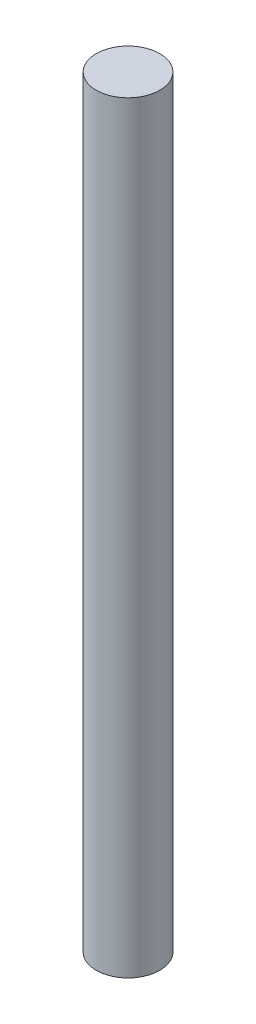
ISO-10303-21;
HEADER;
FILE_DESCRIPTION(('STEP AP214'),'2;1');
FILE_NAME('part.step','',(''),(''),'','','');
FILE_SCHEMA(('AUTOMOTIVE_DESIGN { 1 0 10303 214 1 1 1 1 }'));
ENDSEC;
DATA;
#1=APPLICATION_CONTEXT('core data for automotive mechanical design processes');
#2=APPLICATION_PROTOCOL_DEFINITION('international standard','automotive_design',2000,#1);
#3=PRODUCT_CONTEXT('',#1,'mechanical');
#4=PRODUCT('Part','Part','',(#3));
#5=PRODUCT_RELATED_PRODUCT_CATEGORY('part','',(#4));
#6=PRODUCT_DEFINITION_FORMATION('','',#4);
#7=PRODUCT_DEFINITION_CONTEXT('part definition',#1,'design');
#8=PRODUCT_DEFINITION('design','',#6,#7);
#9=PRODUCT_DEFINITION_SHAPE('','',#8);
#10=(LENGTH_UNIT() NAMED_UNIT(*) SI_UNIT(.MILLI.,.METRE.));
#11=(NAMED_UNIT(*) PLANE_ANGLE_UNIT() SI_UNIT($,.RADIAN.));
#12=(NAMED_UNIT(*) SI_UNIT($,.STERADIAN.) SOLID_ANGLE_UNIT());
#13=UNCERTAINTY_MEASURE_WITH_UNIT(LENGTH_MEASURE(1.E-05),#10,'distance_accuracy_value','');
#14=(GEOMETRIC_REPRESENTATION_CONTEXT(3) GLOBAL_UNCERTAINTY_ASSIGNED_CONTEXT((#13)) GLOBAL_UNIT_ASSIGNED_CONTEXT((#10,
#11,#12)) REPRESENTATION_CONTEXT('',''));
#15=CARTESIAN_POINT('',(0.,0.,0.));
#16=DIRECTION('',(0.,0.,1.));
#17=DIRECTION('',(1.,0.,0.));
#18=AXIS2_PLACEMENT_3D('',#15,#16,#17);
#19=CARTESIAN_POINT('',(0.,304.8,0.));
#20=DIRECTION('',(0.,-1.,0.));
#21=DIRECTION('',(0.,0.,-1.));
#22=AXIS2_PLACEMENT_3D('',#19,#20,#21);
#23=CYLINDRICAL_SURFACE('',#22,12.7);
#24=CARTESIAN_POINT('',(0.,304.8,0.));
#25=DIRECTION('',(0.,1.,0.));
#26=DIRECTION('',(0.,0.,1.));
#27=AXIS2_PLACEMENT_3D('',#24,#25,#26);
#28=CIRCLE('',#27,12.7);
#29=CARTESIAN_POINT('',(0.,304.8,-12.7));
#30=VERTEX_POINT('',#29);
#31=EDGE_CURVE('E11',#30,#30,#28,.T.);
#32=CARTESIAN_POINT('',(0.,0.,0.));
#33=DIRECTION('',(0.,1.,0.));
#34=DIRECTION('',(0.,0.,1.));
#35=AXIS2_PLACEMENT_3D('',#32,#33,#34);
#36=CIRCLE('',#35,12.7);
#37=CARTESIAN_POINT('',(0.,0.,-12.7));
#38=VERTEX_POINT('',#37);
#39=EDGE_CURVE('E43',#38,#38,#36,.T.);
#40=CARTESIAN_POINT('',(0.,304.8,-12.7));
#41=CARTESIAN_POINT('',(0.,301.625,-12.7));
#42=CARTESIAN_POINT('',(0.,298.45,-12.7));
#43=CARTESIAN_POINT('',(0.,292.1,-12.7));
#44=CARTESIAN_POINT('',(0.,288.925,-12.7));
#45=CARTESIAN_POINT('',(0.,282.575,-12.7));
#46=CARTESIAN_POINT('',(0.,279.4,-12.7));
#47=CARTESIAN_POINT('',(0.,273.05,-12.7));
#48=CARTESIAN_POINT('',(0.,269.875,-12.7));
#49=CARTESIAN_POINT('',(0.,263.525,-12.7));
#50=CARTESIAN_POINT('',(0.,260.35,-12.7));
#51=CARTESIAN_POINT('',(0.,254.,-12.7));
#52=CARTESIAN_POINT('',(0.,250.825,-12.7));
#53=CARTESIAN_POINT('',(0.,244.475,-12.7));
#54=CARTESIAN_POINT('',(0.,241.3,-12.7));
#55=CARTESIAN_POINT('',(0.,234.95,-12.7));
#56=CARTESIAN_POINT('',(0.,231.775,-12.7));
#57=CARTESIAN_POINT('',(0.,225.425,-12.7));
#58=CARTESIAN_POINT('',(0.,222.25,-12.7));
#59=CARTESIAN_POINT('',(0.,215.9,-12.7));
#60=CARTESIAN_POINT('',(0.,212.725,-12.7));
#61=CARTESIAN_POINT('',(0.,206.375,-12.7));
#62=CARTESIAN_POINT('',(0.,203.2,-12.7));
#63=CARTESIAN_POINT('',(0.,196.85,-12.7));
#64=CARTESIAN_POINT('',(0.,193.675,-12.7));
#65=CARTESIAN_POINT('',(0.,187.325,-12.7));
#66=CARTESIAN_POINT('',(0.,184.15,-12.7));
#67=CARTESIAN_POINT('',(0.,177.8,-12.7));
#68=CARTESIAN_POINT('',(0.,174.625,-12.7));
#69=CARTESIAN_POINT('',(0.,168.275,-12.7));
#70=CARTESIAN_POINT('',(0.,165.1,-12.7));
#71=CARTESIAN_POINT('',(0.,158.75,-12.7));
#72=CARTESIAN_POINT('',(0.,155.575,-12.7));
#73=CARTESIAN_POINT('',(0.,149.225,-12.7));
#74=CARTESIAN_POINT('',(0.,146.05,-12.7));
#75=CARTESIAN_POINT('',(0.,139.7,-12.7));
#76=CARTESIAN_POINT('',(0.,136.525,-12.7));
#77=CARTESIAN_POINT('',(0.,130.175,-12.7));
#78=CARTESIAN_POINT('',(0.,127.,-12.7));
#79=CARTESIAN_POINT('',(0.,120.65,-12.7));
#80=CARTESIAN_POINT('',(0.,117.475,-12.7));
#81=CARTESIAN_POINT('',(0.,111.125,-12.7));
#82=CARTESIAN_POINT('',(0.,107.95,-12.7));
#83=CARTESIAN_POINT('',(0.,101.6,-12.7));
#84=CARTESIAN_POINT('',(0.,98.425,-12.7));
#85=CARTESIAN_POINT('',(0.,92.075,-12.7));
#86=CARTESIAN_POINT('',(0.,88.9,-12.7));
#87=CARTESIAN_POINT('',(0.,82.55,-12.7));
#88=CARTESIAN_POINT('',(0.,79.375,-12.7));
#89=CARTESIAN_POINT('',(0.,73.025,-12.7));
#90=CARTESIAN_POINT('',(0.,69.85,-12.7));
#91=CARTESIAN_POINT('',(0.,63.5,-12.7));
#92=CARTESIAN_POINT('',(0.,60.325,-12.7));
#93=CARTESIAN_POINT('',(0.,53.975,-12.7));
#94=CARTESIAN_POINT('',(0.,50.8,-12.7));
#95=CARTESIAN_POINT('',(0.,44.45,-12.7));
#96=CARTESIAN_POINT('',(0.,41.275,-12.7));
#97=CARTESIAN_POINT('',(0.,34.925,-12.7));
#98=CARTESIAN_POINT('',(0.,31.75,-12.7));
#99=CARTESIAN_POINT('',(0.,25.4,-12.7));
#100=CARTESIAN_POINT('',(0.,22.225,-12.7));
#101=CARTESIAN_POINT('',(0.,15.875,-12.7));
#102=CARTESIAN_POINT('',(0.,12.7,-12.7));
#103=CARTESIAN_POINT('',(0.,6.35,-12.7));
#104=CARTESIAN_POINT('',(0.,3.175,-12.7));
#105=CARTESIAN_POINT('',(0.,0.,-12.7));
#106=B_SPLINE_CURVE_WITH_KNOTS('',3,(#40,#41,#42,#43,#44,#45,#46,#47,#48,#49,#50,#51,#52,#53,
#54,#55,#56,#57,#58,#59,#60,#61,#62,#63,#64,#65,#66,#67,#68,#69,#70,#71,#72,#73,#74,#75,#76,#77,
#78,#79,#80,#81,#82,#83,#84,#85,#86,#87,#88,#89,#90,#91,#92,#93,#94,#95,#96,#97,#98,#99,#100,
#101,#102,#103,#104,#105),.UNSPECIFIED.,.F.,.F.,(4,2,2,2,2,2,2,2,2,2,2,2,2,2,2,2,2,2,2,2,2,2,2,
2,2,2,2,2,2,2,2,2,4),(0.,9.52500000000001,19.05,28.575,38.1,47.625,57.15,66.675,76.2,
85.7250000000001,95.2500000000001,104.775,114.3,123.825,133.35,142.875,152.4,161.925,171.45,
180.975,190.5,200.025,209.55,219.075,228.6,238.125,247.65,257.175,266.7,276.225,285.75,295.275,
304.8),.UNSPECIFIED.);
#107=EDGE_CURVE('BSEAM40',#30,#38,#106,.T.);
#108=ORIENTED_EDGE('',*,*,#31,.F.);
#109=ORIENTED_EDGE('',*,*,#39,.T.);
#110=ORIENTED_EDGE('',*,*,#107,.T.);
#111=ORIENTED_EDGE('',*,*,#107,.F.);
#112=EDGE_LOOP('',(#108,#110,#109,#111));
#113=FACE_BOUND('',#112,.T.);
#114=ADVANCED_FACE('F40',(#113),#23,.T.);
#115=CARTESIAN_POINT('',(0.,304.8,0.));
#116=DIRECTION('',(0.,1.,0.));
#117=DIRECTION('',(0.,0.,1.));
#118=AXIS2_PLACEMENT_3D('',#115,#116,#117);
#119=PLANE('',#118);
#120=ORIENTED_EDGE('',*,*,#31,.T.);
#121=EDGE_LOOP('',(#120));
#122=FACE_BOUND('',#121,.T.);
#123=ADVANCED_FACE('F75',(#122),#119,.T.);
#124=CARTESIAN_POINT('',(0.,0.,0.));
#125=DIRECTION('',(0.,1.,0.));
#126=DIRECTION('',(0.,0.,1.));
#127=AXIS2_PLACEMENT_3D('',#124,#125,#126);
#128=PLANE('',#127);
#129=ORIENTED_EDGE('',*,*,#39,.F.);
#130=EDGE_LOOP('',(#129));
#131=FACE_BOUND('',#130,.T.);
#132=ADVANCED_FACE('F77',(#131),#128,.F.);
#133=CLOSED_SHELL('',(#114,#123,#132));
#134=CARTESIAN_POINT('',(0.,302.26,0.));
#135=DIRECTION('',(0.,-1.,0.));
#136=DIRECTION('',(0.,0.,-1.));
#137=AXIS2_PLACEMENT_3D('',#134,#135,#136);
#138=CYLINDRICAL_SURFACE('',#137,9.525);
#139=CARTESIAN_POINT('',(0.,302.26,0.));
#140=DIRECTION('',(0.,1.,0.));
#141=DIRECTION('',(1.,0.,0.));
#142=AXIS2_PLACEMENT_3D('',#139,#140,#141);
#143=CIRCLE('',#142,9.525);
#144=CARTESIAN_POINT('',(9.525,302.26,0.));
#145=VERTEX_POINT('',#144);
#146=EDGE_CURVE('E50',#145,#145,#143,.T.);
#147=ORIENTED_EDGE('',*,*,#146,.T.);
#148=EDGE_LOOP('',(#147));
#149=FACE_BOUND('',#148,.T.);
#150=CARTESIAN_POINT('',(0.,2.54,0.));
#151=DIRECTION('',(0.,1.,0.));
#152=DIRECTION('',(1.,0.,0.));
#153=AXIS2_PLACEMENT_3D('',#150,#151,#152);
#154=CIRCLE('',#153,9.525);
#155=CARTESIAN_POINT('',(9.525,2.54,0.));
#156=VERTEX_POINT('',#155);
#157=EDGE_CURVE('E52',#156,#156,#154,.T.);
#158=ORIENTED_EDGE('',*,*,#157,.F.);
#159=EDGE_LOOP('',(#158));
#160=FACE_BOUND('',#159,.T.);
#161=ADVANCED_FACE('F58',(#149,#160),#138,.F.);
#162=CARTESIAN_POINT('',(0.,302.26,0.));
#163=DIRECTION('',(0.,1.,0.));
#164=DIRECTION('',(0.,0.,1.));
#165=AXIS2_PLACEMENT_3D('',#162,#163,#164);
#166=PLANE('',#165);
#167=ORIENTED_EDGE('',*,*,#146,.F.);
#168=EDGE_LOOP('',(#167));
#169=FACE_BOUND('',#168,.T.);
#170=ADVANCED_FACE('F61',(#169),#166,.F.);
#171=CARTESIAN_POINT('',(0.,2.54,0.));
#172=DIRECTION('',(0.,1.,0.));
#173=DIRECTION('',(0.,0.,1.));
#174=AXIS2_PLACEMENT_3D('',#171,#172,#173);
#175=PLANE('',#174);
#176=ORIENTED_EDGE('',*,*,#157,.T.);
#177=EDGE_LOOP('',(#176));
#178=FACE_BOUND('',#177,.T.);
#179=ADVANCED_FACE('F63',(#178),#175,.T.);
#180=CLOSED_SHELL('',(#161,#170,#179));
#181=ORIENTED_CLOSED_SHELL('',*,#180,.T.);
#182=BREP_WITH_VOIDS('B2',#133,(#181));
#183=ADVANCED_BREP_SHAPE_REPRESENTATION('',(#18,#182),#14);
#184=SHAPE_DEFINITION_REPRESENTATION(#9,#183);
ENDSEC;
END-ISO-10303-21;
